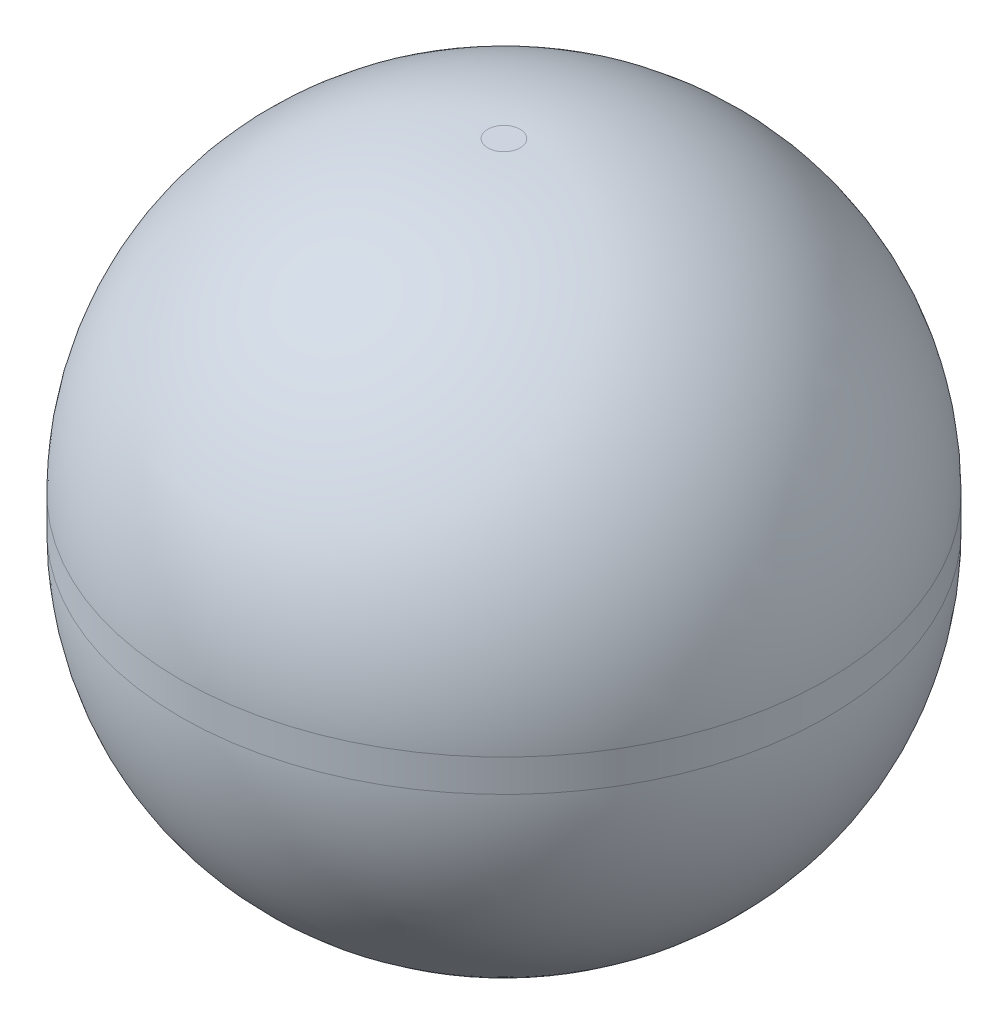
ISO-10303-21;
HEADER;
FILE_DESCRIPTION(('STEP AP214'),'2;1');
FILE_NAME('part.step','',(''),(''),'','','');
FILE_SCHEMA(('AUTOMOTIVE_DESIGN { 1 0 10303 214 1 1 1 1 }'));
ENDSEC;
DATA;
#1=APPLICATION_CONTEXT('core data for automotive mechanical design processes');
#2=APPLICATION_PROTOCOL_DEFINITION('international standard','automotive_design',2000,#1);
#3=PRODUCT_CONTEXT('',#1,'mechanical');
#4=PRODUCT('Part','Part','',(#3));
#5=PRODUCT_RELATED_PRODUCT_CATEGORY('part','',(#4));
#6=PRODUCT_DEFINITION_FORMATION('','',#4);
#7=PRODUCT_DEFINITION_CONTEXT('part definition',#1,'design');
#8=PRODUCT_DEFINITION('design','',#6,#7);
#9=PRODUCT_DEFINITION_SHAPE('','',#8);
#10=(LENGTH_UNIT() NAMED_UNIT(*) SI_UNIT(.MILLI.,.METRE.));
#11=(NAMED_UNIT(*) PLANE_ANGLE_UNIT() SI_UNIT($,.RADIAN.));
#12=(NAMED_UNIT(*) SI_UNIT($,.STERADIAN.) SOLID_ANGLE_UNIT());
#13=UNCERTAINTY_MEASURE_WITH_UNIT(LENGTH_MEASURE(1.E-05),#10,'distance_accuracy_value','');
#14=(GEOMETRIC_REPRESENTATION_CONTEXT(3) GLOBAL_UNCERTAINTY_ASSIGNED_CONTEXT((#13)) GLOBAL_UNIT_ASSIGNED_CONTEXT((#10,
#11,#12)) REPRESENTATION_CONTEXT('',''));
#15=CARTESIAN_POINT('',(0.,0.,0.));
#16=DIRECTION('',(0.,0.,1.));
#17=DIRECTION('',(1.,0.,0.));
#18=AXIS2_PLACEMENT_3D('',#15,#16,#17);
#19=CARTESIAN_POINT('',(0.,40.,0.));
#20=DIRECTION('',(0.,-1.,0.));
#21=DIRECTION('',(0.,0.,-1.));
#22=AXIS2_PLACEMENT_3D('',#19,#20,#21);
#23=CYLINDRICAL_SURFACE('',#22,20.);
#24=CARTESIAN_POINT('',(0.,19.,0.));
#25=DIRECTION('',(0.,1.,0.));
#26=DIRECTION('',(0.,0.,1.));
#27=AXIS2_PLACEMENT_3D('',#24,#25,#26);
#28=CIRCLE('',#27,20.);
#29=CARTESIAN_POINT('',(0.,19.,20.));
#30=VERTEX_POINT('',#29);
#31=EDGE_CURVE('E39',#30,#30,#28,.T.);
#32=ORIENTED_EDGE('',*,*,#31,.T.);
#33=EDGE_LOOP('',(#32));
#34=FACE_BOUND('',#33,.T.);
#35=CARTESIAN_POINT('',(0.,21.,0.));
#36=DIRECTION('',(0.,1.,0.));
#37=DIRECTION('',(0.,0.,1.));
#38=AXIS2_PLACEMENT_3D('',#35,#36,#37);
#39=CIRCLE('',#38,20.);
#40=CARTESIAN_POINT('',(0.,21.,20.));
#41=VERTEX_POINT('',#40);
#42=EDGE_CURVE('E43',#41,#41,#39,.F.);
#43=ORIENTED_EDGE('',*,*,#42,.T.);
#44=EDGE_LOOP('',(#43));
#45=FACE_BOUND('',#44,.T.);
#46=ADVANCED_FACE('F28',(#34,#45),#23,.T.);
#47=CARTESIAN_POINT('',(0.,40.,0.));
#48=DIRECTION('',(0.,1.,0.));
#49=DIRECTION('',(0.,0.,1.));
#50=AXIS2_PLACEMENT_3D('',#47,#48,#49);
#51=PLANE('',#50);
#52=CARTESIAN_POINT('',(0.,40.,0.));
#53=DIRECTION('',(0.,1.,0.));
#54=DIRECTION('',(0.,0.,1.));
#55=AXIS2_PLACEMENT_3D('',#52,#53,#54);
#56=CIRCLE('',#55,1.);
#57=CARTESIAN_POINT('',(0.,40.,1.));
#58=VERTEX_POINT('',#57);
#59=EDGE_CURVE('E10',#58,#58,#56,.T.);
#60=ORIENTED_EDGE('',*,*,#59,.T.);
#61=EDGE_LOOP('',(#60));
#62=FACE_BOUND('',#61,.T.);
#63=ADVANCED_FACE('F59',(#62),#51,.T.);
#64=CARTESIAN_POINT('',(0.,0.,0.));
#65=DIRECTION('',(0.,1.,0.));
#66=DIRECTION('',(0.,0.,1.));
#67=AXIS2_PLACEMENT_3D('',#64,#65,#66);
#68=PLANE('',#67);
#69=CARTESIAN_POINT('',(0.,0.,0.));
#70=DIRECTION('',(0.,1.,0.));
#71=DIRECTION('',(0.,0.,1.));
#72=AXIS2_PLACEMENT_3D('',#69,#70,#71);
#73=CIRCLE('',#72,1.);
#74=CARTESIAN_POINT('',(0.,0.,1.));
#75=VERTEX_POINT('',#74);
#76=EDGE_CURVE('E35',#75,#75,#73,.F.);
#77=ORIENTED_EDGE('',*,*,#76,.T.);
#78=EDGE_LOOP('',(#77));
#79=FACE_BOUND('',#78,.T.);
#80=ADVANCED_FACE('F56',(#79),#68,.F.);
#81=CARTESIAN_POINT('',(0.,19.,0.));
#82=DIRECTION('',(0.,1.,0.));
#83=DIRECTION('',(0.,0.,1.));
#84=AXIS2_PLACEMENT_3D('',#81,#82,#83);
#85=DEGENERATE_TOROIDAL_SURFACE('',#84,1.,19.,.T.);
#86=ORIENTED_EDGE('',*,*,#76,.F.);
#87=EDGE_LOOP('',(#86));
#88=FACE_BOUND('',#87,.T.);
#89=ORIENTED_EDGE('',*,*,#31,.F.);
#90=EDGE_LOOP('',(#89));
#91=FACE_BOUND('',#90,.T.);
#92=ADVANCED_FACE('F52',(#88,#91),#85,.T.);
#93=CARTESIAN_POINT('',(0.,21.,0.));
#94=DIRECTION('',(0.,1.,0.));
#95=DIRECTION('',(0.,0.,1.));
#96=AXIS2_PLACEMENT_3D('',#93,#94,#95);
#97=DEGENERATE_TOROIDAL_SURFACE('',#96,1.,19.,.T.);
#98=ORIENTED_EDGE('',*,*,#42,.F.);
#99=EDGE_LOOP('',(#98));
#100=FACE_BOUND('',#99,.T.);
#101=ORIENTED_EDGE('',*,*,#59,.F.);
#102=EDGE_LOOP('',(#101));
#103=FACE_BOUND('',#102,.T.);
#104=ADVANCED_FACE('F30',(#100,#103),#97,.T.);
#105=CLOSED_SHELL('',(#46,#63,#80,#92,#104));
#106=MANIFOLD_SOLID_BREP('B2',#105);
#107=ADVANCED_BREP_SHAPE_REPRESENTATION('',(#18,#106),#14);
#108=SHAPE_DEFINITION_REPRESENTATION(#9,#107);
ENDSEC;
END-ISO-10303-21;
